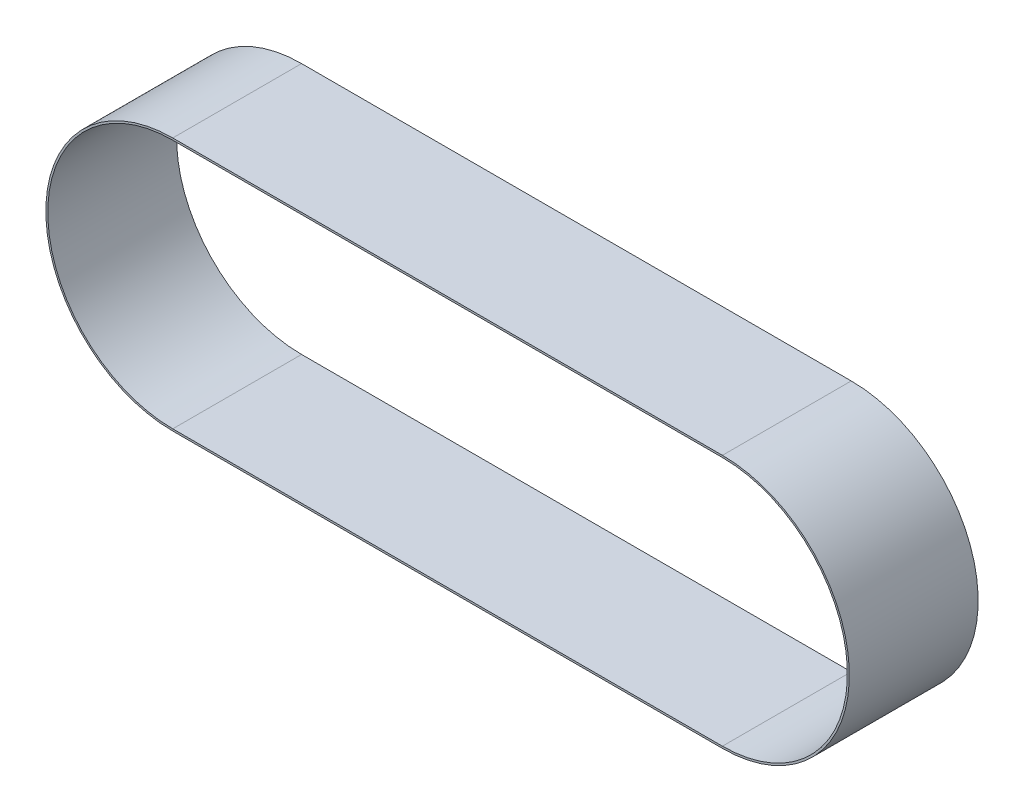
ISO-10303-21;
HEADER;
FILE_DESCRIPTION(('STEP AP214'),'2;1');
FILE_NAME('part.step','',(''),(''),'','','');
FILE_SCHEMA(('AUTOMOTIVE_DESIGN { 1 0 10303 214 1 1 1 1 }'));
ENDSEC;
DATA;
#1=APPLICATION_CONTEXT('core data for automotive mechanical design processes');
#2=APPLICATION_PROTOCOL_DEFINITION('international standard','automotive_design',2000,#1);
#3=PRODUCT_CONTEXT('',#1,'mechanical');
#4=PRODUCT('Part','Part','',(#3));
#5=PRODUCT_RELATED_PRODUCT_CATEGORY('part','',(#4));
#6=PRODUCT_DEFINITION_FORMATION('','',#4);
#7=PRODUCT_DEFINITION_CONTEXT('part definition',#1,'design');
#8=PRODUCT_DEFINITION('design','',#6,#7);
#9=PRODUCT_DEFINITION_SHAPE('','',#8);
#10=(LENGTH_UNIT() NAMED_UNIT(*) SI_UNIT(.MILLI.,.METRE.));
#11=(NAMED_UNIT(*) PLANE_ANGLE_UNIT() SI_UNIT($,.RADIAN.));
#12=(NAMED_UNIT(*) SI_UNIT($,.STERADIAN.) SOLID_ANGLE_UNIT());
#13=UNCERTAINTY_MEASURE_WITH_UNIT(LENGTH_MEASURE(1.E-05),#10,'distance_accuracy_value','');
#14=(GEOMETRIC_REPRESENTATION_CONTEXT(3) GLOBAL_UNCERTAINTY_ASSIGNED_CONTEXT((#13)) GLOBAL_UNIT_ASSIGNED_CONTEXT((#10,
#11,#12)) REPRESENTATION_CONTEXT('',''));
#15=CARTESIAN_POINT('',(0.,0.,0.));
#16=DIRECTION('',(0.,0.,1.));
#17=DIRECTION('',(1.,0.,0.));
#18=AXIS2_PLACEMENT_3D('',#15,#16,#17);
#19=CARTESIAN_POINT('',(0.,29.105,30.));
#20=DIRECTION('',(0.,1.,0.));
#21=DIRECTION('',(-1.,0.,0.));
#22=AXIS2_PLACEMENT_3D('',#19,#20,#21);
#23=PLANE('',#22);
#24=DIRECTION('',(1.,0.,0.));
#25=VECTOR('',#24,1.);
#26=CARTESIAN_POINT('',(0.,29.105,0.));
#27=LINE('',#26,#25);
#28=CARTESIAN_POINT('',(0.,29.105,0.));
#29=VERTEX_POINT('',#28);
#30=CARTESIAN_POINT('',(128.,29.105,0.));
#31=VERTEX_POINT('',#30);
#32=EDGE_CURVE('E145',#29,#31,#27,.T.);
#33=ORIENTED_EDGE('',*,*,#32,.T.);
#34=DIRECTION('',(0.,0.,-1.));
#35=VECTOR('',#34,1.);
#36=CARTESIAN_POINT('',(128.,29.105,30.));
#37=LINE('',#36,#35);
#38=CARTESIAN_POINT('',(128.,29.105,30.));
#39=VERTEX_POINT('',#38);
#40=EDGE_CURVE('E11',#39,#31,#37,.T.);
#41=ORIENTED_EDGE('',*,*,#40,.F.);
#42=DIRECTION('',(1.,0.,0.));
#43=VECTOR('',#42,1.);
#44=CARTESIAN_POINT('',(0.,29.105,30.));
#45=LINE('',#44,#43);
#46=CARTESIAN_POINT('',(0.,29.105,30.));
#47=VERTEX_POINT('',#46);
#48=EDGE_CURVE('E124',#47,#39,#45,.T.);
#49=ORIENTED_EDGE('',*,*,#48,.F.);
#50=DIRECTION('',(0.,0.,-1.));
#51=VECTOR('',#50,1.);
#52=CARTESIAN_POINT('',(0.,29.105,30.));
#53=LINE('',#52,#51);
#54=EDGE_CURVE('E54',#47,#29,#53,.T.);
#55=ORIENTED_EDGE('',*,*,#54,.T.);
#56=EDGE_LOOP('',(#33,#41,#49,#55));
#57=FACE_BOUND('',#56,.T.);
#58=ADVANCED_FACE('F35',(#57),#23,.F.);
#59=CARTESIAN_POINT('',(128.,0.,30.));
#60=DIRECTION('',(0.,0.,-1.));
#61=DIRECTION('',(-1.,0.,0.));
#62=AXIS2_PLACEMENT_3D('',#59,#60,#61);
#63=CYLINDRICAL_SURFACE('',#62,29.105);
#64=CARTESIAN_POINT('',(128.,0.,0.));
#65=DIRECTION('',(0.,0.,1.));
#66=DIRECTION('',(1.,0.,0.));
#67=AXIS2_PLACEMENT_3D('',#64,#65,#66);
#68=CIRCLE('',#67,29.105);
#69=CARTESIAN_POINT('',(128.,-29.105,0.));
#70=VERTEX_POINT('',#69);
#71=EDGE_CURVE('E113',#70,#31,#68,.T.);
#72=ORIENTED_EDGE('',*,*,#71,.F.);
#73=DIRECTION('',(0.,0.,-1.));
#74=VECTOR('',#73,1.);
#75=CARTESIAN_POINT('',(128.,-29.105,30.));
#76=LINE('',#75,#74);
#77=CARTESIAN_POINT('',(128.,-29.105,30.));
#78=VERTEX_POINT('',#77);
#79=EDGE_CURVE('E45',#78,#70,#76,.T.);
#80=ORIENTED_EDGE('',*,*,#79,.F.);
#81=CARTESIAN_POINT('',(128.,0.,30.));
#82=DIRECTION('',(0.,0.,1.));
#83=DIRECTION('',(1.,0.,0.));
#84=AXIS2_PLACEMENT_3D('',#81,#82,#83);
#85=CIRCLE('',#84,29.105);
#86=EDGE_CURVE('E111',#78,#39,#85,.T.);
#87=ORIENTED_EDGE('',*,*,#86,.T.);
#88=ORIENTED_EDGE('',*,*,#40,.T.);
#89=EDGE_LOOP('',(#72,#80,#87,#88));
#90=FACE_BOUND('',#89,.T.);
#91=ADVANCED_FACE('F109',(#90),#63,.F.);
#92=CARTESIAN_POINT('',(0.,-29.105,30.));
#93=DIRECTION('',(0.,-1.,0.));
#94=DIRECTION('',(1.,0.,0.));
#95=AXIS2_PLACEMENT_3D('',#92,#93,#94);
#96=PLANE('',#95);
#97=DIRECTION('',(-1.,0.,0.));
#98=VECTOR('',#97,1.);
#99=CARTESIAN_POINT('',(0.,-29.105,0.));
#100=LINE('',#99,#98);
#101=CARTESIAN_POINT('',(0.,-29.105,0.));
#102=VERTEX_POINT('',#101);
#103=EDGE_CURVE('E148',#70,#102,#100,.T.);
#104=ORIENTED_EDGE('',*,*,#103,.T.);
#105=DIRECTION('',(0.,0.,-1.));
#106=VECTOR('',#105,1.);
#107=CARTESIAN_POINT('',(0.,-29.105,30.));
#108=LINE('',#107,#106);
#109=CARTESIAN_POINT('',(0.,-29.105,30.));
#110=VERTEX_POINT('',#109);
#111=EDGE_CURVE('E80',#110,#102,#108,.T.);
#112=ORIENTED_EDGE('',*,*,#111,.F.);
#113=DIRECTION('',(-1.,0.,0.));
#114=VECTOR('',#113,1.);
#115=CARTESIAN_POINT('',(0.,-29.105,30.));
#116=LINE('',#115,#114);
#117=EDGE_CURVE('E117',#78,#110,#116,.T.);
#118=ORIENTED_EDGE('',*,*,#117,.F.);
#119=ORIENTED_EDGE('',*,*,#79,.T.);
#120=EDGE_LOOP('',(#104,#112,#118,#119));
#121=FACE_BOUND('',#120,.T.);
#122=ADVANCED_FACE('F118',(#121),#96,.F.);
#123=CARTESIAN_POINT('',(0.,-29.555,30.));
#124=DIRECTION('',(0.,-1.,0.));
#125=DIRECTION('',(1.,0.,0.));
#126=AXIS2_PLACEMENT_3D('',#123,#124,#125);
#127=PLANE('',#126);
#128=DIRECTION('',(-1.,0.,0.));
#129=VECTOR('',#128,1.);
#130=CARTESIAN_POINT('',(0.,-29.555,0.));
#131=LINE('',#130,#129);
#132=CARTESIAN_POINT('',(128.,-29.555,0.));
#133=VERTEX_POINT('',#132);
#134=CARTESIAN_POINT('',(0.,-29.555,0.));
#135=VERTEX_POINT('',#134);
#136=EDGE_CURVE('E133',#133,#135,#131,.T.);
#137=ORIENTED_EDGE('',*,*,#136,.F.);
#138=DIRECTION('',(0.,0.,-1.));
#139=VECTOR('',#138,1.);
#140=CARTESIAN_POINT('',(128.,-29.555,30.));
#141=LINE('',#140,#139);
#142=CARTESIAN_POINT('',(128.,-29.555,30.));
#143=VERTEX_POINT('',#142);
#144=EDGE_CURVE('E39',#143,#133,#141,.T.);
#145=ORIENTED_EDGE('',*,*,#144,.F.);
#146=DIRECTION('',(-1.,0.,0.));
#147=VECTOR('',#146,1.);
#148=CARTESIAN_POINT('',(0.,-29.555,30.));
#149=LINE('',#148,#147);
#150=CARTESIAN_POINT('',(0.,-29.555,30.));
#151=VERTEX_POINT('',#150);
#152=EDGE_CURVE('E153',#143,#151,#149,.T.);
#153=ORIENTED_EDGE('',*,*,#152,.T.);
#154=DIRECTION('',(0.,0.,-1.));
#155=VECTOR('',#154,1.);
#156=CARTESIAN_POINT('',(0.,-29.555,30.));
#157=LINE('',#156,#155);
#158=EDGE_CURVE('E132',#151,#135,#157,.T.);
#159=ORIENTED_EDGE('',*,*,#158,.T.);
#160=EDGE_LOOP('',(#137,#145,#153,#159));
#161=FACE_BOUND('',#160,.T.);
#162=ADVANCED_FACE('F37',(#161),#127,.T.);
#163=CARTESIAN_POINT('',(128.,0.,30.));
#164=DIRECTION('',(0.,0.,-1.));
#165=DIRECTION('',(-1.,0.,0.));
#166=AXIS2_PLACEMENT_3D('',#163,#164,#165);
#167=CYLINDRICAL_SURFACE('',#166,29.555);
#168=CARTESIAN_POINT('',(128.,0.,0.));
#169=DIRECTION('',(0.,0.,1.));
#170=DIRECTION('',(1.,0.,0.));
#171=AXIS2_PLACEMENT_3D('',#168,#169,#170);
#172=CIRCLE('',#171,29.555);
#173=CARTESIAN_POINT('',(128.,29.555,0.));
#174=VERTEX_POINT('',#173);
#175=EDGE_CURVE('E136',#133,#174,#172,.T.);
#176=ORIENTED_EDGE('',*,*,#175,.T.);
#177=DIRECTION('',(0.,0.,-1.));
#178=VECTOR('',#177,1.);
#179=CARTESIAN_POINT('',(128.,29.555,30.));
#180=LINE('',#179,#178);
#181=CARTESIAN_POINT('',(128.,29.555,30.));
#182=VERTEX_POINT('',#181);
#183=EDGE_CURVE('E158',#182,#174,#180,.T.);
#184=ORIENTED_EDGE('',*,*,#183,.F.);
#185=CARTESIAN_POINT('',(128.,0.,30.));
#186=DIRECTION('',(0.,0.,1.));
#187=DIRECTION('',(1.,0.,0.));
#188=AXIS2_PLACEMENT_3D('',#185,#186,#187);
#189=CIRCLE('',#188,29.555);
#190=EDGE_CURVE('E166',#143,#182,#189,.T.);
#191=ORIENTED_EDGE('',*,*,#190,.F.);
#192=ORIENTED_EDGE('',*,*,#144,.T.);
#193=EDGE_LOOP('',(#176,#184,#191,#192));
#194=FACE_BOUND('',#193,.T.);
#195=ADVANCED_FACE('F165',(#194),#167,.T.);
#196=CARTESIAN_POINT('',(0.,29.555,30.));
#197=DIRECTION('',(0.,1.,0.));
#198=DIRECTION('',(-1.,0.,0.));
#199=AXIS2_PLACEMENT_3D('',#196,#197,#198);
#200=PLANE('',#199);
#201=DIRECTION('',(1.,0.,0.));
#202=VECTOR('',#201,1.);
#203=CARTESIAN_POINT('',(0.,29.555,0.));
#204=LINE('',#203,#202);
#205=CARTESIAN_POINT('',(0.,29.555,0.));
#206=VERTEX_POINT('',#205);
#207=EDGE_CURVE('E139',#206,#174,#204,.T.);
#208=ORIENTED_EDGE('',*,*,#207,.F.);
#209=DIRECTION('',(0.,0.,-1.));
#210=VECTOR('',#209,1.);
#211=CARTESIAN_POINT('',(0.,29.555,30.));
#212=LINE('',#211,#210);
#213=CARTESIAN_POINT('',(0.,29.555,30.));
#214=VERTEX_POINT('',#213);
#215=EDGE_CURVE('E157',#214,#206,#212,.T.);
#216=ORIENTED_EDGE('',*,*,#215,.F.);
#217=DIRECTION('',(1.,0.,0.));
#218=VECTOR('',#217,1.);
#219=CARTESIAN_POINT('',(0.,29.555,30.));
#220=LINE('',#219,#218);
#221=EDGE_CURVE('E178',#214,#182,#220,.T.);
#222=ORIENTED_EDGE('',*,*,#221,.T.);
#223=ORIENTED_EDGE('',*,*,#183,.T.);
#224=EDGE_LOOP('',(#208,#216,#222,#223));
#225=FACE_BOUND('',#224,.T.);
#226=ADVANCED_FACE('F176',(#225),#200,.T.);
#227=CARTESIAN_POINT('',(0.,0.,30.));
#228=DIRECTION('',(0.,0.,-1.));
#229=DIRECTION('',(-1.,0.,0.));
#230=AXIS2_PLACEMENT_3D('',#227,#228,#229);
#231=CYLINDRICAL_SURFACE('',#230,29.555);
#232=CARTESIAN_POINT('',(0.,0.,0.));
#233=DIRECTION('',(0.,0.,1.));
#234=DIRECTION('',(1.,0.,0.));
#235=AXIS2_PLACEMENT_3D('',#232,#233,#234);
#236=CIRCLE('',#235,29.555);
#237=EDGE_CURVE('E142',#206,#135,#236,.T.);
#238=ORIENTED_EDGE('',*,*,#237,.T.);
#239=ORIENTED_EDGE('',*,*,#158,.F.);
#240=CARTESIAN_POINT('',(0.,0.,30.));
#241=DIRECTION('',(0.,0.,1.));
#242=DIRECTION('',(1.,0.,0.));
#243=AXIS2_PLACEMENT_3D('',#240,#241,#242);
#244=CIRCLE('',#243,29.555);
#245=EDGE_CURVE('E127',#214,#151,#244,.T.);
#246=ORIENTED_EDGE('',*,*,#245,.F.);
#247=ORIENTED_EDGE('',*,*,#215,.T.);
#248=EDGE_LOOP('',(#238,#239,#246,#247));
#249=FACE_BOUND('',#248,.T.);
#250=ADVANCED_FACE('F175',(#249),#231,.T.);
#251=CARTESIAN_POINT('',(0.,0.,30.));
#252=DIRECTION('',(0.,0.,-1.));
#253=DIRECTION('',(-1.,0.,0.));
#254=AXIS2_PLACEMENT_3D('',#251,#252,#253);
#255=CYLINDRICAL_SURFACE('',#254,29.105);
#256=CARTESIAN_POINT('',(0.,0.,0.));
#257=DIRECTION('',(0.,0.,1.));
#258=DIRECTION('',(1.,0.,0.));
#259=AXIS2_PLACEMENT_3D('',#256,#257,#258);
#260=CIRCLE('',#259,29.105);
#261=EDGE_CURVE('E150',#29,#102,#260,.T.);
#262=ORIENTED_EDGE('',*,*,#261,.F.);
#263=ORIENTED_EDGE('',*,*,#54,.F.);
#264=CARTESIAN_POINT('',(0.,0.,30.));
#265=DIRECTION('',(0.,0.,1.));
#266=DIRECTION('',(1.,0.,0.));
#267=AXIS2_PLACEMENT_3D('',#264,#265,#266);
#268=CIRCLE('',#267,29.105);
#269=EDGE_CURVE('E121',#47,#110,#268,.T.);
#270=ORIENTED_EDGE('',*,*,#269,.T.);
#271=ORIENTED_EDGE('',*,*,#111,.T.);
#272=EDGE_LOOP('',(#262,#263,#270,#271));
#273=FACE_BOUND('',#272,.T.);
#274=ADVANCED_FACE('F184',(#273),#255,.F.);
#275=CARTESIAN_POINT('',(0.,0.,30.));
#276=DIRECTION('',(0.,0.,1.));
#277=DIRECTION('',(1.,0.,0.));
#278=AXIS2_PLACEMENT_3D('',#275,#276,#277);
#279=PLANE('',#278);
#280=ORIENTED_EDGE('',*,*,#152,.F.);
#281=ORIENTED_EDGE('',*,*,#190,.T.);
#282=ORIENTED_EDGE('',*,*,#221,.F.);
#283=ORIENTED_EDGE('',*,*,#245,.T.);
#284=EDGE_LOOP('',(#280,#281,#282,#283));
#285=FACE_BOUND('',#284,.T.);
#286=ORIENTED_EDGE('',*,*,#48,.T.);
#287=ORIENTED_EDGE('',*,*,#86,.F.);
#288=ORIENTED_EDGE('',*,*,#117,.T.);
#289=ORIENTED_EDGE('',*,*,#269,.F.);
#290=EDGE_LOOP('',(#286,#287,#288,#289));
#291=FACE_BOUND('',#290,.T.);
#292=ADVANCED_FACE('F123',(#285,#291),#279,.T.);
#293=CARTESIAN_POINT('',(0.,0.,0.));
#294=DIRECTION('',(0.,0.,1.));
#295=DIRECTION('',(1.,0.,0.));
#296=AXIS2_PLACEMENT_3D('',#293,#294,#295);
#297=PLANE('',#296);
#298=ORIENTED_EDGE('',*,*,#136,.T.);
#299=ORIENTED_EDGE('',*,*,#237,.F.);
#300=ORIENTED_EDGE('',*,*,#207,.T.);
#301=ORIENTED_EDGE('',*,*,#175,.F.);
#302=EDGE_LOOP('',(#298,#299,#300,#301));
#303=FACE_BOUND('',#302,.T.);
#304=ORIENTED_EDGE('',*,*,#32,.F.);
#305=ORIENTED_EDGE('',*,*,#261,.T.);
#306=ORIENTED_EDGE('',*,*,#103,.F.);
#307=ORIENTED_EDGE('',*,*,#71,.T.);
#308=EDGE_LOOP('',(#304,#305,#306,#307));
#309=FACE_BOUND('',#308,.T.);
#310=ADVANCED_FACE('F169',(#303,#309),#297,.F.);
#311=CLOSED_SHELL('',(#58,#91,#122,#162,#195,#226,#250,#274,#292,#310));
#312=MANIFOLD_SOLID_BREP('B2',#311);
#313=ADVANCED_BREP_SHAPE_REPRESENTATION('',(#18,#312),#14);
#314=SHAPE_DEFINITION_REPRESENTATION(#9,#313);
ENDSEC;
END-ISO-10303-21;
